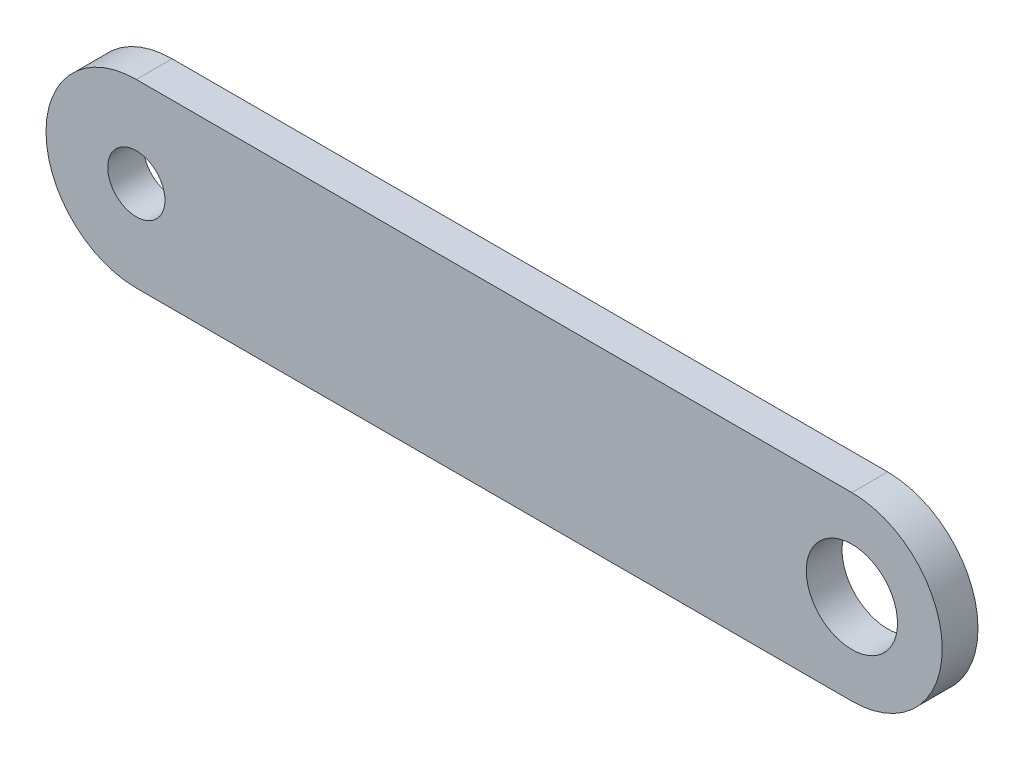
ISO-10303-21;
HEADER;
FILE_DESCRIPTION(('STEP AP214'),'2;1');
FILE_NAME('part.step','',(''),(''),'','','');
FILE_SCHEMA(('AUTOMOTIVE_DESIGN { 1 0 10303 214 1 1 1 1 }'));
ENDSEC;
DATA;
#1=APPLICATION_CONTEXT('core data for automotive mechanical design processes');
#2=APPLICATION_PROTOCOL_DEFINITION('international standard','automotive_design',2000,#1);
#3=PRODUCT_CONTEXT('',#1,'mechanical');
#4=PRODUCT('Part','Part','',(#3));
#5=PRODUCT_RELATED_PRODUCT_CATEGORY('part','',(#4));
#6=PRODUCT_DEFINITION_FORMATION('','',#4);
#7=PRODUCT_DEFINITION_CONTEXT('part definition',#1,'design');
#8=PRODUCT_DEFINITION('design','',#6,#7);
#9=PRODUCT_DEFINITION_SHAPE('','',#8);
#10=(LENGTH_UNIT() NAMED_UNIT(*) SI_UNIT(.MILLI.,.METRE.));
#11=(NAMED_UNIT(*) PLANE_ANGLE_UNIT() SI_UNIT($,.RADIAN.));
#12=(NAMED_UNIT(*) SI_UNIT($,.STERADIAN.) SOLID_ANGLE_UNIT());
#13=UNCERTAINTY_MEASURE_WITH_UNIT(LENGTH_MEASURE(1.E-05),#10,'distance_accuracy_value','');
#14=(GEOMETRIC_REPRESENTATION_CONTEXT(3) GLOBAL_UNCERTAINTY_ASSIGNED_CONTEXT((#13)) GLOBAL_UNIT_ASSIGNED_CONTEXT((#10,
#11,#12)) REPRESENTATION_CONTEXT('',''));
#15=CARTESIAN_POINT('',(0.,0.,0.));
#16=DIRECTION('',(0.,0.,1.));
#17=DIRECTION('',(1.,0.,0.));
#18=AXIS2_PLACEMENT_3D('',#15,#16,#17);
#19=CARTESIAN_POINT('',(-20.,0.,2.));
#20=DIRECTION('',(0.,0.,1.));
#21=DIRECTION('',(1.,0.,0.));
#22=AXIS2_PLACEMENT_3D('',#19,#20,#21);
#23=PLANE('',#22);
#24=CARTESIAN_POINT('',(-20.,0.,2.));
#25=DIRECTION('',(0.,0.,1.));
#26=DIRECTION('',(1.,0.,0.));
#27=AXIS2_PLACEMENT_3D('',#24,#25,#26);
#28=CIRCLE('',#27,1.6);
#29=CARTESIAN_POINT('',(-18.4,0.,2.));
#30=VERTEX_POINT('',#29);
#31=EDGE_CURVE('E124',#30,#30,#28,.T.);
#32=ORIENTED_EDGE('',*,*,#31,.F.);
#33=EDGE_LOOP('',(#32));
#34=FACE_BOUND('',#33,.T.);
#35=CARTESIAN_POINT('',(-20.,0.,2.));
#36=DIRECTION('',(0.,0.,1.));
#37=DIRECTION('',(1.,0.,0.));
#38=AXIS2_PLACEMENT_3D('',#35,#36,#37);
#39=CIRCLE('',#38,5.05);
#40=CARTESIAN_POINT('',(-20.,5.05,2.));
#41=VERTEX_POINT('',#40);
#42=CARTESIAN_POINT('',(-20.,-5.05,2.));
#43=VERTEX_POINT('',#42);
#44=EDGE_CURVE('E92',#41,#43,#39,.T.);
#45=ORIENTED_EDGE('',*,*,#44,.T.);
#46=DIRECTION('',(1.,0.,0.));
#47=VECTOR('',#46,1.);
#48=CARTESIAN_POINT('',(-20.,-5.05,2.));
#49=LINE('',#48,#47);
#50=CARTESIAN_POINT('',(20.,-5.05,2.));
#51=VERTEX_POINT('',#50);
#52=EDGE_CURVE('E87',#43,#51,#49,.T.);
#53=ORIENTED_EDGE('',*,*,#52,.T.);
#54=CARTESIAN_POINT('',(20.,0.,2.));
#55=DIRECTION('',(0.,0.,1.));
#56=DIRECTION('',(1.,0.,0.));
#57=AXIS2_PLACEMENT_3D('',#54,#55,#56);
#58=CIRCLE('',#57,5.05);
#59=CARTESIAN_POINT('',(20.,5.05,2.));
#60=VERTEX_POINT('',#59);
#61=EDGE_CURVE('E90',#51,#60,#58,.T.);
#62=ORIENTED_EDGE('',*,*,#61,.T.);
#63=DIRECTION('',(-1.,0.,0.));
#64=VECTOR('',#63,1.);
#65=CARTESIAN_POINT('',(-20.,5.05,2.));
#66=LINE('',#65,#64);
#67=EDGE_CURVE('E57',#60,#41,#66,.T.);
#68=ORIENTED_EDGE('',*,*,#67,.T.);
#69=EDGE_LOOP('',(#45,#53,#62,#68));
#70=FACE_BOUND('',#69,.T.);
#71=CARTESIAN_POINT('',(20.,0.,2.));
#72=DIRECTION('',(0.,0.,1.));
#73=DIRECTION('',(1.,0.,0.));
#74=AXIS2_PLACEMENT_3D('',#71,#72,#73);
#75=CIRCLE('',#74,2.55);
#76=CARTESIAN_POINT('',(22.55,0.,2.));
#77=VERTEX_POINT('',#76);
#78=EDGE_CURVE('E125',#77,#77,#75,.T.);
#79=ORIENTED_EDGE('',*,*,#78,.F.);
#80=EDGE_LOOP('',(#79));
#81=FACE_BOUND('',#80,.T.);
#82=ADVANCED_FACE('F39',(#34,#70,#81),#23,.T.);
#83=CARTESIAN_POINT('',(-20.,0.,0.));
#84=DIRECTION('',(0.,0.,1.));
#85=DIRECTION('',(1.,0.,0.));
#86=AXIS2_PLACEMENT_3D('',#83,#84,#85);
#87=PLANE('',#86);
#88=CARTESIAN_POINT('',(-20.,0.,0.));
#89=DIRECTION('',(0.,0.,1.));
#90=DIRECTION('',(1.,0.,0.));
#91=AXIS2_PLACEMENT_3D('',#88,#89,#90);
#92=CIRCLE('',#91,1.6);
#93=CARTESIAN_POINT('',(-18.4,0.,0.));
#94=VERTEX_POINT('',#93);
#95=EDGE_CURVE('E121',#94,#94,#92,.T.);
#96=ORIENTED_EDGE('',*,*,#95,.T.);
#97=EDGE_LOOP('',(#96));
#98=FACE_BOUND('',#97,.T.);
#99=CARTESIAN_POINT('',(-20.,0.,0.));
#100=DIRECTION('',(0.,0.,1.));
#101=DIRECTION('',(1.,0.,0.));
#102=AXIS2_PLACEMENT_3D('',#99,#100,#101);
#103=CIRCLE('',#102,5.05);
#104=CARTESIAN_POINT('',(-20.,5.05,0.));
#105=VERTEX_POINT('',#104);
#106=CARTESIAN_POINT('',(-20.,-5.05,0.));
#107=VERTEX_POINT('',#106);
#108=EDGE_CURVE('E130',#105,#107,#103,.T.);
#109=ORIENTED_EDGE('',*,*,#108,.F.);
#110=DIRECTION('',(-1.,0.,0.));
#111=VECTOR('',#110,1.);
#112=CARTESIAN_POINT('',(-20.,5.05,0.));
#113=LINE('',#112,#111);
#114=CARTESIAN_POINT('',(20.,5.05,0.));
#115=VERTEX_POINT('',#114);
#116=EDGE_CURVE('E80',#115,#105,#113,.T.);
#117=ORIENTED_EDGE('',*,*,#116,.F.);
#118=CARTESIAN_POINT('',(20.,0.,0.));
#119=DIRECTION('',(0.,0.,1.));
#120=DIRECTION('',(1.,0.,0.));
#121=AXIS2_PLACEMENT_3D('',#118,#119,#120);
#122=CIRCLE('',#121,5.05);
#123=CARTESIAN_POINT('',(20.,-5.05,0.));
#124=VERTEX_POINT('',#123);
#125=EDGE_CURVE('E74',#124,#115,#122,.T.);
#126=ORIENTED_EDGE('',*,*,#125,.F.);
#127=DIRECTION('',(1.,0.,0.));
#128=VECTOR('',#127,1.);
#129=CARTESIAN_POINT('',(-20.,-5.05,0.));
#130=LINE('',#129,#128);
#131=EDGE_CURVE('E97',#107,#124,#130,.T.);
#132=ORIENTED_EDGE('',*,*,#131,.F.);
#133=EDGE_LOOP('',(#109,#117,#126,#132));
#134=FACE_BOUND('',#133,.T.);
#135=CARTESIAN_POINT('',(20.,0.,0.));
#136=DIRECTION('',(0.,0.,1.));
#137=DIRECTION('',(1.,0.,0.));
#138=AXIS2_PLACEMENT_3D('',#135,#136,#137);
#139=CIRCLE('',#138,2.55);
#140=CARTESIAN_POINT('',(22.55,0.,0.));
#141=VERTEX_POINT('',#140);
#142=EDGE_CURVE('E131',#141,#141,#139,.T.);
#143=ORIENTED_EDGE('',*,*,#142,.T.);
#144=EDGE_LOOP('',(#143));
#145=FACE_BOUND('',#144,.T.);
#146=ADVANCED_FACE('F142',(#98,#134,#145),#87,.F.);
#147=CARTESIAN_POINT('',(-20.,0.,2.));
#148=DIRECTION('',(0.,0.,-1.));
#149=DIRECTION('',(-1.,0.,0.));
#150=AXIS2_PLACEMENT_3D('',#147,#148,#149);
#151=CYLINDRICAL_SURFACE('',#150,5.05);
#152=ORIENTED_EDGE('',*,*,#108,.T.);
#153=DIRECTION('',(0.,0.,-1.));
#154=VECTOR('',#153,1.);
#155=CARTESIAN_POINT('',(-20.,-5.05,2.));
#156=LINE('',#155,#154);
#157=EDGE_CURVE('E12',#43,#107,#156,.T.);
#158=ORIENTED_EDGE('',*,*,#157,.F.);
#159=ORIENTED_EDGE('',*,*,#44,.F.);
#160=DIRECTION('',(0.,0.,-1.));
#161=VECTOR('',#160,1.);
#162=CARTESIAN_POINT('',(-20.,5.05,2.));
#163=LINE('',#162,#161);
#164=EDGE_CURVE('E106',#41,#105,#163,.T.);
#165=ORIENTED_EDGE('',*,*,#164,.T.);
#166=EDGE_LOOP('',(#152,#158,#159,#165));
#167=FACE_BOUND('',#166,.T.);
#168=ADVANCED_FACE('F41',(#167),#151,.T.);
#169=CARTESIAN_POINT('',(-20.,-5.05,2.));
#170=DIRECTION('',(0.,1.,0.));
#171=DIRECTION('',(0.,0.,1.));
#172=AXIS2_PLACEMENT_3D('',#169,#170,#171);
#173=PLANE('',#172);
#174=ORIENTED_EDGE('',*,*,#131,.T.);
#175=DIRECTION('',(0.,0.,-1.));
#176=VECTOR('',#175,1.);
#177=CARTESIAN_POINT('',(20.,-5.05,2.));
#178=LINE('',#177,#176);
#179=EDGE_CURVE('E49',#51,#124,#178,.T.);
#180=ORIENTED_EDGE('',*,*,#179,.F.);
#181=ORIENTED_EDGE('',*,*,#52,.F.);
#182=ORIENTED_EDGE('',*,*,#157,.T.);
#183=EDGE_LOOP('',(#174,#180,#181,#182));
#184=FACE_BOUND('',#183,.T.);
#185=ADVANCED_FACE('F96',(#184),#173,.F.);
#186=CARTESIAN_POINT('',(20.,0.,2.));
#187=DIRECTION('',(0.,0.,-1.));
#188=DIRECTION('',(-1.,0.,0.));
#189=AXIS2_PLACEMENT_3D('',#186,#187,#188);
#190=CYLINDRICAL_SURFACE('',#189,5.05);
#191=ORIENTED_EDGE('',*,*,#125,.T.);
#192=DIRECTION('',(0.,0.,-1.));
#193=VECTOR('',#192,1.);
#194=CARTESIAN_POINT('',(20.,5.05,2.));
#195=LINE('',#194,#193);
#196=EDGE_CURVE('E99',#60,#115,#195,.T.);
#197=ORIENTED_EDGE('',*,*,#196,.F.);
#198=ORIENTED_EDGE('',*,*,#61,.F.);
#199=ORIENTED_EDGE('',*,*,#179,.T.);
#200=EDGE_LOOP('',(#191,#197,#198,#199));
#201=FACE_BOUND('',#200,.T.);
#202=ADVANCED_FACE('F100',(#201),#190,.T.);
#203=CARTESIAN_POINT('',(-20.,5.05,2.));
#204=DIRECTION('',(0.,-1.,0.));
#205=DIRECTION('',(0.,0.,-1.));
#206=AXIS2_PLACEMENT_3D('',#203,#204,#205);
#207=PLANE('',#206);
#208=ORIENTED_EDGE('',*,*,#116,.T.);
#209=ORIENTED_EDGE('',*,*,#164,.F.);
#210=ORIENTED_EDGE('',*,*,#67,.F.);
#211=ORIENTED_EDGE('',*,*,#196,.T.);
#212=EDGE_LOOP('',(#208,#209,#210,#211));
#213=FACE_BOUND('',#212,.T.);
#214=ADVANCED_FACE('F155',(#213),#207,.F.);
#215=CARTESIAN_POINT('',(-20.,0.,2.));
#216=DIRECTION('',(0.,0.,-1.));
#217=DIRECTION('',(-1.,0.,0.));
#218=AXIS2_PLACEMENT_3D('',#215,#216,#217);
#219=CYLINDRICAL_SURFACE('',#218,1.6);
#220=ORIENTED_EDGE('',*,*,#31,.T.);
#221=EDGE_LOOP('',(#220));
#222=FACE_BOUND('',#221,.T.);
#223=ORIENTED_EDGE('',*,*,#95,.F.);
#224=EDGE_LOOP('',(#223));
#225=FACE_BOUND('',#224,.T.);
#226=ADVANCED_FACE('F152',(#222,#225),#219,.F.);
#227=CARTESIAN_POINT('',(20.,0.,2.));
#228=DIRECTION('',(0.,0.,-1.));
#229=DIRECTION('',(-1.,0.,0.));
#230=AXIS2_PLACEMENT_3D('',#227,#228,#229);
#231=CYLINDRICAL_SURFACE('',#230,2.55);
#232=ORIENTED_EDGE('',*,*,#78,.T.);
#233=EDGE_LOOP('',(#232));
#234=FACE_BOUND('',#233,.T.);
#235=ORIENTED_EDGE('',*,*,#142,.F.);
#236=EDGE_LOOP('',(#235));
#237=FACE_BOUND('',#236,.T.);
#238=ADVANCED_FACE('F139',(#234,#237),#231,.F.);
#239=CLOSED_SHELL('',(#82,#146,#168,#185,#202,#214,#226,#238));
#240=MANIFOLD_SOLID_BREP('B2',#239);
#241=ADVANCED_BREP_SHAPE_REPRESENTATION('',(#18,#240),#14);
#242=SHAPE_DEFINITION_REPRESENTATION(#9,#241);
ENDSEC;
END-ISO-10303-21;
